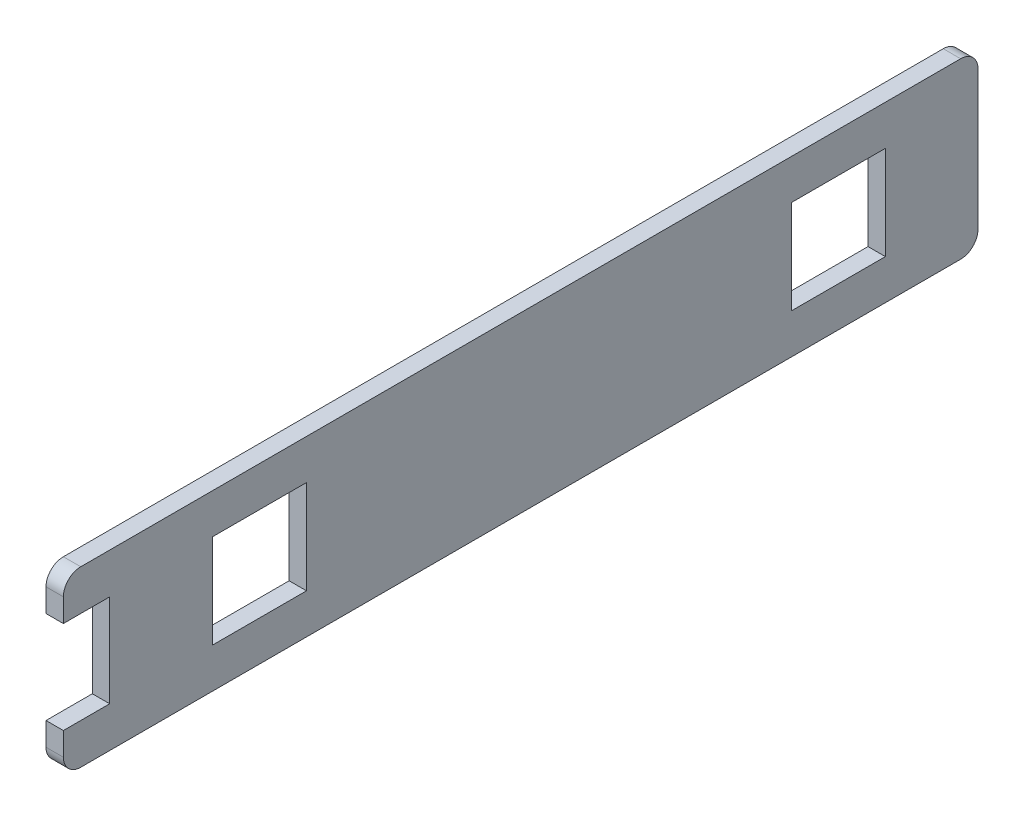
ISO-10303-21;
HEADER;
FILE_DESCRIPTION(('STEP AP214'),'2;1');
FILE_NAME('part.step','',(''),(''),'','','');
FILE_SCHEMA(('AUTOMOTIVE_DESIGN { 1 0 10303 214 1 1 1 1 }'));
ENDSEC;
DATA;
#1=APPLICATION_CONTEXT('core data for automotive mechanical design processes');
#2=APPLICATION_PROTOCOL_DEFINITION('international standard','automotive_design',2000,#1);
#3=PRODUCT_CONTEXT('',#1,'mechanical');
#4=PRODUCT('Part','Part','',(#3));
#5=PRODUCT_RELATED_PRODUCT_CATEGORY('part','',(#4));
#6=PRODUCT_DEFINITION_FORMATION('','',#4);
#7=PRODUCT_DEFINITION_CONTEXT('part definition',#1,'design');
#8=PRODUCT_DEFINITION('design','',#6,#7);
#9=PRODUCT_DEFINITION_SHAPE('','',#8);
#10=(LENGTH_UNIT() NAMED_UNIT(*) SI_UNIT(.MILLI.,.METRE.));
#11=(NAMED_UNIT(*) PLANE_ANGLE_UNIT() SI_UNIT($,.RADIAN.));
#12=(NAMED_UNIT(*) SI_UNIT($,.STERADIAN.) SOLID_ANGLE_UNIT());
#13=UNCERTAINTY_MEASURE_WITH_UNIT(LENGTH_MEASURE(1.E-05),#10,'distance_accuracy_value','');
#14=(GEOMETRIC_REPRESENTATION_CONTEXT(3) GLOBAL_UNCERTAINTY_ASSIGNED_CONTEXT((#13)) GLOBAL_UNIT_ASSIGNED_CONTEXT((#10,
#11,#12)) REPRESENTATION_CONTEXT('',''));
#15=CARTESIAN_POINT('',(0.,0.,0.));
#16=DIRECTION('',(0.,0.,1.));
#17=DIRECTION('',(1.,0.,0.));
#18=AXIS2_PLACEMENT_3D('',#15,#16,#17);
#19=CARTESIAN_POINT('',(630.000000000001,-2.70932974371986E-13,-790.));
#20=DIRECTION('',(0.,0.,-1.));
#21=DIRECTION('',(-1.,0.,0.));
#22=AXIS2_PLACEMENT_3D('',#19,#20,#21);
#23=PLANE('',#22);
#24=DIRECTION('',(0.,1.,0.));
#25=VECTOR('',#24,1.);
#26=CARTESIAN_POINT('',(645.000000000001,-2.7644388496815E-13,-790.));
#27=LINE('',#26,#25);
#28=CARTESIAN_POINT('',(645.000000000001,-0.500000000000002,-790.));
#29=VERTEX_POINT('',#28);
#30=CARTESIAN_POINT('',(645.000000000001,80.5,-790.));
#31=VERTEX_POINT('',#30);
#32=EDGE_CURVE('E263',#29,#31,#27,.T.);
#33=ORIENTED_EDGE('',*,*,#32,.T.);
#34=DIRECTION('',(1.,0.,0.));
#35=VECTOR('',#34,1.);
#36=CARTESIAN_POINT('',(630.000000000001,80.5,-790.));
#37=LINE('',#36,#35);
#38=CARTESIAN_POINT('',(630.000000000001,80.5,-790.));
#39=VERTEX_POINT('',#38);
#40=EDGE_CURVE('E283',#39,#31,#37,.T.);
#41=ORIENTED_EDGE('',*,*,#40,.F.);
#42=DIRECTION('',(0.,1.,0.));
#43=VECTOR('',#42,1.);
#44=CARTESIAN_POINT('',(630.000000000001,-2.70932974371986E-13,-790.));
#45=LINE('',#44,#43);
#46=CARTESIAN_POINT('',(630.000000000001,-0.499999999999996,-790.));
#47=VERTEX_POINT('',#46);
#48=EDGE_CURVE('E220',#47,#39,#45,.T.);
#49=ORIENTED_EDGE('',*,*,#48,.F.);
#50=DIRECTION('',(1.,0.,0.));
#51=VECTOR('',#50,1.);
#52=CARTESIAN_POINT('',(630.000000000001,-0.499999999999996,-790.));
#53=LINE('',#52,#51);
#54=EDGE_CURVE('E275',#47,#29,#53,.T.);
#55=ORIENTED_EDGE('',*,*,#54,.T.);
#56=EDGE_LOOP('',(#33,#41,#49,#55));
#57=FACE_BOUND('',#56,.T.);
#58=ADVANCED_FACE('F34',(#57),#23,.F.);
#59=CARTESIAN_POINT('',(630.,80.5,2.69782546820399E-13));
#60=DIRECTION('',(0.,-1.,0.));
#61=DIRECTION('',(1.,0.,0.));
#62=AXIS2_PLACEMENT_3D('',#59,#60,#61);
#63=PLANE('',#62);
#64=DIRECTION('',(0.,0.,-1.));
#65=VECTOR('',#64,1.);
#66=CARTESIAN_POINT('',(645.,80.5,2.7644388496815E-13));
#67=LINE('',#66,#65);
#68=CARTESIAN_POINT('',(645.000000000001,80.5,-709.));
#69=VERTEX_POINT('',#68);
#70=EDGE_CURVE('E266',#69,#31,#67,.T.);
#71=ORIENTED_EDGE('',*,*,#70,.F.);
#72=DIRECTION('',(1.,0.,0.));
#73=VECTOR('',#72,1.);
#74=CARTESIAN_POINT('',(630.000000000001,80.5,-709.));
#75=LINE('',#74,#73);
#76=CARTESIAN_POINT('',(630.000000000001,80.5,-709.));
#77=VERTEX_POINT('',#76);
#78=EDGE_CURVE('E281',#77,#69,#75,.T.);
#79=ORIENTED_EDGE('',*,*,#78,.F.);
#80=DIRECTION('',(0.,0.,-1.));
#81=VECTOR('',#80,1.);
#82=CARTESIAN_POINT('',(630.,80.5,2.69782546820399E-13));
#83=LINE('',#82,#81);
#84=EDGE_CURVE('E222',#77,#39,#83,.T.);
#85=ORIENTED_EDGE('',*,*,#84,.T.);
#86=ORIENTED_EDGE('',*,*,#40,.T.);
#87=EDGE_LOOP('',(#71,#79,#85,#86));
#88=FACE_BOUND('',#87,.T.);
#89=ADVANCED_FACE('F367',(#88),#63,.T.);
#90=CARTESIAN_POINT('',(630.000000000001,-2.70932974371986E-13,-709.));
#91=DIRECTION('',(0.,0.,-1.));
#92=DIRECTION('',(-1.,0.,0.));
#93=AXIS2_PLACEMENT_3D('',#90,#91,#92);
#94=PLANE('',#93);
#95=DIRECTION('',(0.,1.,0.));
#96=VECTOR('',#95,1.);
#97=CARTESIAN_POINT('',(645.000000000001,-2.7644388496815E-13,-709.));
#98=LINE('',#97,#96);
#99=CARTESIAN_POINT('',(645.000000000001,-0.500000000000002,-709.));
#100=VERTEX_POINT('',#99);
#101=EDGE_CURVE('E269',#100,#69,#98,.T.);
#102=ORIENTED_EDGE('',*,*,#101,.F.);
#103=DIRECTION('',(1.,0.,0.));
#104=VECTOR('',#103,1.);
#105=CARTESIAN_POINT('',(630.000000000001,-0.499999999999996,-709.));
#106=LINE('',#105,#104);
#107=CARTESIAN_POINT('',(630.000000000001,-0.499999999999996,-709.));
#108=VERTEX_POINT('',#107);
#109=EDGE_CURVE('E278',#108,#100,#106,.T.);
#110=ORIENTED_EDGE('',*,*,#109,.F.);
#111=DIRECTION('',(0.,1.,0.));
#112=VECTOR('',#111,1.);
#113=CARTESIAN_POINT('',(630.000000000001,-2.70932974371986E-13,-709.));
#114=LINE('',#113,#112);
#115=EDGE_CURVE('E225',#108,#77,#114,.T.);
#116=ORIENTED_EDGE('',*,*,#115,.T.);
#117=ORIENTED_EDGE('',*,*,#78,.T.);
#118=EDGE_LOOP('',(#102,#110,#116,#117));
#119=FACE_BOUND('',#118,.T.);
#120=ADVANCED_FACE('F373',(#119),#94,.T.);
#121=CARTESIAN_POINT('',(630.,80.5,2.69782546820399E-13));
#122=DIRECTION('',(0.,-1.,0.));
#123=DIRECTION('',(1.,0.,0.));
#124=AXIS2_PLACEMENT_3D('',#121,#122,#123);
#125=PLANE('',#124);
#126=DIRECTION('',(0.,0.,-1.));
#127=VECTOR('',#126,1.);
#128=CARTESIAN_POINT('',(645.,80.5,2.7644388496815E-13));
#129=LINE('',#128,#127);
#130=CARTESIAN_POINT('',(645.,80.5,-208.999999999999));
#131=VERTEX_POINT('',#130);
#132=CARTESIAN_POINT('',(645.,80.5,-289.999999999999));
#133=VERTEX_POINT('',#132);
#134=EDGE_CURVE('E251',#131,#133,#129,.T.);
#135=ORIENTED_EDGE('',*,*,#134,.F.);
#136=DIRECTION('',(1.,0.,0.));
#137=VECTOR('',#136,1.);
#138=CARTESIAN_POINT('',(630.,80.5,-208.999999999999));
#139=LINE('',#138,#137);
#140=CARTESIAN_POINT('',(630.,80.5,-208.999999999999));
#141=VERTEX_POINT('',#140);
#142=EDGE_CURVE('E279',#141,#131,#139,.T.);
#143=ORIENTED_EDGE('',*,*,#142,.F.);
#144=DIRECTION('',(0.,0.,-1.));
#145=VECTOR('',#144,1.);
#146=CARTESIAN_POINT('',(630.,80.5,2.69782546820399E-13));
#147=LINE('',#146,#145);
#148=CARTESIAN_POINT('',(630.,80.5,-289.999999999999));
#149=VERTEX_POINT('',#148);
#150=EDGE_CURVE('E209',#141,#149,#147,.T.);
#151=ORIENTED_EDGE('',*,*,#150,.T.);
#152=DIRECTION('',(1.,0.,0.));
#153=VECTOR('',#152,1.);
#154=CARTESIAN_POINT('',(630.,80.5,-289.999999999999));
#155=LINE('',#154,#153);
#156=EDGE_CURVE('E193',#149,#133,#155,.T.);
#157=ORIENTED_EDGE('',*,*,#156,.T.);
#158=EDGE_LOOP('',(#135,#143,#151,#157));
#159=FACE_BOUND('',#158,.T.);
#160=ADVANCED_FACE('F390',(#159),#125,.T.);
#161=CARTESIAN_POINT('',(630.,-2.70932974371986E-13,-208.999999999999));
#162=DIRECTION('',(0.,0.,-1.));
#163=DIRECTION('',(-1.,0.,0.));
#164=AXIS2_PLACEMENT_3D('',#161,#162,#163);
#165=PLANE('',#164);
#166=DIRECTION('',(0.,1.,0.));
#167=VECTOR('',#166,1.);
#168=CARTESIAN_POINT('',(645.,-2.7644388496815E-13,-208.999999999999));
#169=LINE('',#168,#167);
#170=CARTESIAN_POINT('',(645.,-0.500000000000015,-208.999999999999));
#171=VERTEX_POINT('',#170);
#172=EDGE_CURVE('E254',#171,#131,#169,.T.);
#173=ORIENTED_EDGE('',*,*,#172,.F.);
#174=DIRECTION('',(1.,0.,0.));
#175=VECTOR('',#174,1.);
#176=CARTESIAN_POINT('',(630.,-0.50000000000001,-208.999999999999));
#177=LINE('',#176,#175);
#178=CARTESIAN_POINT('',(630.,-0.50000000000001,-208.999999999999));
#179=VERTEX_POINT('',#178);
#180=EDGE_CURVE('E290',#179,#171,#177,.T.);
#181=ORIENTED_EDGE('',*,*,#180,.F.);
#182=DIRECTION('',(0.,1.,0.));
#183=VECTOR('',#182,1.);
#184=CARTESIAN_POINT('',(630.,-2.70932974371986E-13,-208.999999999999));
#185=LINE('',#184,#183);
#186=EDGE_CURVE('E212',#179,#141,#185,.T.);
#187=ORIENTED_EDGE('',*,*,#186,.T.);
#188=ORIENTED_EDGE('',*,*,#142,.T.);
#189=EDGE_LOOP('',(#173,#181,#187,#188));
#190=FACE_BOUND('',#189,.T.);
#191=ADVANCED_FACE('F386',(#190),#165,.T.);
#192=CARTESIAN_POINT('',(630.,-0.50000000000001,2.69782546820399E-13));
#193=DIRECTION('',(0.,-1.,0.));
#194=DIRECTION('',(1.,0.,0.));
#195=AXIS2_PLACEMENT_3D('',#192,#193,#194);
#196=PLANE('',#195);
#197=DIRECTION('',(0.,0.,-1.));
#198=VECTOR('',#197,1.);
#199=CARTESIAN_POINT('',(645.,-0.500000000000015,2.7644388496815E-13));
#200=LINE('',#199,#198);
#201=CARTESIAN_POINT('',(645.,-0.500000000000015,-289.999999999999));
#202=VERTEX_POINT('',#201);
#203=EDGE_CURVE('E257',#171,#202,#200,.T.);
#204=ORIENTED_EDGE('',*,*,#203,.T.);
#205=DIRECTION('',(1.,0.,0.));
#206=VECTOR('',#205,1.);
#207=CARTESIAN_POINT('',(630.,-0.50000000000001,-289.999999999999));
#208=LINE('',#207,#206);
#209=CARTESIAN_POINT('',(630.,-0.50000000000001,-289.999999999999));
#210=VERTEX_POINT('',#209);
#211=EDGE_CURVE('E287',#210,#202,#208,.T.);
#212=ORIENTED_EDGE('',*,*,#211,.F.);
#213=DIRECTION('',(0.,0.,-1.));
#214=VECTOR('',#213,1.);
#215=CARTESIAN_POINT('',(630.,-0.50000000000001,2.69782546820399E-13));
#216=LINE('',#215,#214);
#217=EDGE_CURVE('E215',#179,#210,#216,.T.);
#218=ORIENTED_EDGE('',*,*,#217,.F.);
#219=ORIENTED_EDGE('',*,*,#180,.T.);
#220=EDGE_LOOP('',(#204,#212,#218,#219));
#221=FACE_BOUND('',#220,.T.);
#222=ADVANCED_FACE('F383',(#221),#196,.F.);
#223=CARTESIAN_POINT('',(630.,115.,2.69782546820399E-13));
#224=DIRECTION('',(0.,-1.,0.));
#225=DIRECTION('',(1.,0.,0.));
#226=AXIS2_PLACEMENT_3D('',#223,#224,#225);
#227=PLANE('',#226);
#228=DIRECTION('',(0.,0.,-1.));
#229=VECTOR('',#228,1.);
#230=CARTESIAN_POINT('',(630.,115.,2.69782546820399E-13));
#231=LINE('',#230,#229);
#232=CARTESIAN_POINT('',(630.,115.,-95.0000000000012));
#233=VERTEX_POINT('',#232);
#234=CARTESIAN_POINT('',(630.000000000001,115.,-855.000000000001));
#235=VERTEX_POINT('',#234);
#236=EDGE_CURVE('E274',#233,#235,#231,.T.);
#237=ORIENTED_EDGE('',*,*,#236,.F.);
#238=DIRECTION('',(1.,0.,0.));
#239=VECTOR('',#238,1.);
#240=CARTESIAN_POINT('',(645.,115.,-95.0000000000012));
#241=LINE('',#240,#239);
#242=CARTESIAN_POINT('',(645.,115.,-95.0000000000012));
#243=VERTEX_POINT('',#242);
#244=EDGE_CURVE('E320',#233,#243,#241,.T.);
#245=ORIENTED_EDGE('',*,*,#244,.T.);
#246=DIRECTION('',(0.,0.,-1.));
#247=VECTOR('',#246,1.);
#248=CARTESIAN_POINT('',(645.,115.,2.7644388496815E-13));
#249=LINE('',#248,#247);
#250=CARTESIAN_POINT('',(645.000000000001,115.,-855.000000000001));
#251=VERTEX_POINT('',#250);
#252=EDGE_CURVE('E231',#243,#251,#249,.T.);
#253=ORIENTED_EDGE('',*,*,#252,.T.);
#254=DIRECTION('',(1.,0.,0.));
#255=VECTOR('',#254,1.);
#256=CARTESIAN_POINT('',(630.000000000001,115.,-855.000000000001));
#257=LINE('',#256,#255);
#258=EDGE_CURVE('E318',#251,#235,#257,.F.);
#259=ORIENTED_EDGE('',*,*,#258,.T.);
#260=EDGE_LOOP('',(#237,#245,#253,#259));
#261=FACE_BOUND('',#260,.T.);
#262=ADVANCED_FACE('F351',(#261),#227,.F.);
#263=CARTESIAN_POINT('',(630.000000000001,-2.70932974371986E-13,-870.000000000001));
#264=DIRECTION('',(0.,0.,-1.));
#265=DIRECTION('',(-1.,0.,0.));
#266=AXIS2_PLACEMENT_3D('',#263,#264,#265);
#267=PLANE('',#266);
#268=DIRECTION('',(0.,1.,0.));
#269=VECTOR('',#268,1.);
#270=CARTESIAN_POINT('',(645.000000000001,-2.7644388496815E-13,-870.000000000001));
#271=LINE('',#270,#269);
#272=CARTESIAN_POINT('',(645.000000000001,-20.,-870.000000000001));
#273=VERTEX_POINT('',#272);
#274=CARTESIAN_POINT('',(645.000000000001,100.,-870.000000000001));
#275=VERTEX_POINT('',#274);
#276=EDGE_CURVE('E234',#273,#275,#271,.T.);
#277=ORIENTED_EDGE('',*,*,#276,.F.);
#278=DIRECTION('',(1.,0.,0.));
#279=VECTOR('',#278,1.);
#280=CARTESIAN_POINT('',(630.000000000001,-20.,-870.000000000001));
#281=LINE('',#280,#279);
#282=CARTESIAN_POINT('',(630.000000000001,-20.,-870.000000000001));
#283=VERTEX_POINT('',#282);
#284=EDGE_CURVE('E11',#273,#283,#281,.F.);
#285=ORIENTED_EDGE('',*,*,#284,.T.);
#286=DIRECTION('',(0.,1.,0.));
#287=VECTOR('',#286,1.);
#288=CARTESIAN_POINT('',(630.000000000001,-2.70932974371986E-13,-870.000000000001));
#289=LINE('',#288,#287);
#290=CARTESIAN_POINT('',(630.000000000001,100.,-870.000000000001));
#291=VERTEX_POINT('',#290);
#292=EDGE_CURVE('E329',#283,#291,#289,.T.);
#293=ORIENTED_EDGE('',*,*,#292,.T.);
#294=DIRECTION('',(1.,0.,0.));
#295=VECTOR('',#294,1.);
#296=CARTESIAN_POINT('',(645.000000000001,100.,-870.000000000001));
#297=LINE('',#296,#295);
#298=EDGE_CURVE('E42',#291,#275,#297,.T.);
#299=ORIENTED_EDGE('',*,*,#298,.T.);
#300=EDGE_LOOP('',(#277,#285,#293,#299));
#301=FACE_BOUND('',#300,.T.);
#302=ADVANCED_FACE('F327',(#301),#267,.T.);
#303=CARTESIAN_POINT('',(630.,-35.,2.69782546820399E-13));
#304=DIRECTION('',(0.,1.,0.));
#305=DIRECTION('',(-1.,0.,0.));
#306=AXIS2_PLACEMENT_3D('',#303,#304,#305);
#307=PLANE('',#306);
#308=DIRECTION('',(0.,0.,1.));
#309=VECTOR('',#308,1.);
#310=CARTESIAN_POINT('',(645.,-35.,2.7644388496815E-13));
#311=LINE('',#310,#309);
#312=CARTESIAN_POINT('',(645.000000000001,-35.,-855.000000000001));
#313=VERTEX_POINT('',#312);
#314=CARTESIAN_POINT('',(645.,-35.,-95.0000000000012));
#315=VERTEX_POINT('',#314);
#316=EDGE_CURVE('E237',#313,#315,#311,.T.);
#317=ORIENTED_EDGE('',*,*,#316,.T.);
#318=DIRECTION('',(1.,0.,0.));
#319=VECTOR('',#318,1.);
#320=CARTESIAN_POINT('',(630.,-35.,-95.0000000000012));
#321=LINE('',#320,#319);
#322=CARTESIAN_POINT('',(630.,-35.,-95.0000000000012));
#323=VERTEX_POINT('',#322);
#324=EDGE_CURVE('E310',#315,#323,#321,.F.);
#325=ORIENTED_EDGE('',*,*,#324,.T.);
#326=DIRECTION('',(0.,0.,1.));
#327=VECTOR('',#326,1.);
#328=CARTESIAN_POINT('',(630.,-35.,2.69782546820399E-13));
#329=LINE('',#328,#327);
#330=CARTESIAN_POINT('',(630.000000000001,-35.,-855.000000000001));
#331=VERTEX_POINT('',#330);
#332=EDGE_CURVE('E184',#331,#323,#329,.T.);
#333=ORIENTED_EDGE('',*,*,#332,.F.);
#334=DIRECTION('',(1.,0.,0.));
#335=VECTOR('',#334,1.);
#336=CARTESIAN_POINT('',(645.000000000001,-35.,-855.000000000001));
#337=LINE('',#336,#335);
#338=EDGE_CURVE('E307',#331,#313,#337,.T.);
#339=ORIENTED_EDGE('',*,*,#338,.T.);
#340=EDGE_LOOP('',(#317,#325,#333,#339));
#341=FACE_BOUND('',#340,.T.);
#342=ADVANCED_FACE('F342',(#341),#307,.F.);
#343=CARTESIAN_POINT('',(630.,-2.70932974371986E-13,-80.0000000000012));
#344=DIRECTION('',(0.,0.,-1.));
#345=DIRECTION('',(-1.,0.,0.));
#346=AXIS2_PLACEMENT_3D('',#343,#344,#345);
#347=PLANE('',#346);
#348=DIRECTION('',(0.,1.,0.));
#349=VECTOR('',#348,1.);
#350=CARTESIAN_POINT('',(630.,-2.70932974371986E-13,-80.0000000000012));
#351=LINE('',#350,#349);
#352=CARTESIAN_POINT('',(630.,-20.,-80.0000000000012));
#353=VERTEX_POINT('',#352);
#354=CARTESIAN_POINT('',(630.,-7.80232127397164E-13,-80.0000000000012));
#355=VERTEX_POINT('',#354);
#356=EDGE_CURVE('E171',#353,#355,#351,.T.);
#357=ORIENTED_EDGE('',*,*,#356,.F.);
#358=DIRECTION('',(1.,0.,0.));
#359=VECTOR('',#358,1.);
#360=CARTESIAN_POINT('',(630.,-20.,-80.0000000000012));
#361=LINE('',#360,#359);
#362=CARTESIAN_POINT('',(645.,-20.,-80.0000000000012));
#363=VERTEX_POINT('',#362);
#364=EDGE_CURVE('E285',#353,#363,#361,.T.);
#365=ORIENTED_EDGE('',*,*,#364,.T.);
#366=DIRECTION('',(0.,1.,0.));
#367=VECTOR('',#366,1.);
#368=CARTESIAN_POINT('',(645.,-2.7644388496815E-13,-80.0000000000012));
#369=LINE('',#368,#367);
#370=CARTESIAN_POINT('',(645.,-7.85743037993328E-13,-80.0000000000012));
#371=VERTEX_POINT('',#370);
#372=EDGE_CURVE('E190',#363,#371,#369,.T.);
#373=ORIENTED_EDGE('',*,*,#372,.T.);
#374=DIRECTION('',(1.,0.,0.));
#375=VECTOR('',#374,1.);
#376=CARTESIAN_POINT('',(630.,-7.80232127397164E-13,-80.0000000000012));
#377=LINE('',#376,#375);
#378=EDGE_CURVE('E187',#355,#371,#377,.T.);
#379=ORIENTED_EDGE('',*,*,#378,.F.);
#380=EDGE_LOOP('',(#357,#365,#373,#379));
#381=FACE_BOUND('',#380,.T.);
#382=ADVANCED_FACE('F188',(#381),#347,.F.);
#383=CARTESIAN_POINT('',(630.,-1.13235357946908E-13,2.69782546820397E-13));
#384=DIRECTION('',(0.,-1.,0.));
#385=DIRECTION('',(0.,0.,-1.));
#386=AXIS2_PLACEMENT_3D('',#383,#384,#385);
#387=PLANE('',#386);
#388=DIRECTION('',(0.,0.,-1.));
#389=VECTOR('',#388,1.);
#390=CARTESIAN_POINT('',(645.,-1.18746268543072E-13,2.76443884968148E-13));
#391=LINE('',#390,#389);
#392=CARTESIAN_POINT('',(645.,-5.06816847453418E-11,-120.000000000001));
#393=VERTEX_POINT('',#392);
#394=EDGE_CURVE('E241',#371,#393,#391,.T.);
#395=ORIENTED_EDGE('',*,*,#394,.T.);
#396=DIRECTION('',(1.,0.,0.));
#397=VECTOR('',#396,1.);
#398=CARTESIAN_POINT('',(630.,-5.06761738347456E-11,-120.000000000001));
#399=LINE('',#398,#397);
#400=CARTESIAN_POINT('',(630.,-5.06761738347456E-11,-120.000000000001));
#401=VERTEX_POINT('',#400);
#402=EDGE_CURVE('E194',#401,#393,#399,.T.);
#403=ORIENTED_EDGE('',*,*,#402,.F.);
#404=DIRECTION('',(0.,0.,-1.));
#405=VECTOR('',#404,1.);
#406=CARTESIAN_POINT('',(630.,-1.13235357946908E-13,2.69782546820397E-13));
#407=LINE('',#406,#405);
#408=EDGE_CURVE('E177',#355,#401,#407,.T.);
#409=ORIENTED_EDGE('',*,*,#408,.F.);
#410=ORIENTED_EDGE('',*,*,#378,.T.);
#411=EDGE_LOOP('',(#395,#403,#409,#410));
#412=FACE_BOUND('',#411,.T.);
#413=ADVANCED_FACE('F196',(#412),#387,.F.);
#414=CARTESIAN_POINT('',(630.,-2.70932974371986E-13,-120.000000000001));
#415=DIRECTION('',(0.,0.,-1.));
#416=DIRECTION('',(-1.,0.,0.));
#417=AXIS2_PLACEMENT_3D('',#414,#415,#416);
#418=PLANE('',#417);
#419=DIRECTION('',(0.,1.,0.));
#420=VECTOR('',#419,1.);
#421=CARTESIAN_POINT('',(645.,-2.7644388496815E-13,-120.000000000001));
#422=LINE('',#421,#420);
#423=CARTESIAN_POINT('',(645.,79.9999999999989,-120.000000000001));
#424=VERTEX_POINT('',#423);
#425=EDGE_CURVE('E243',#393,#424,#422,.T.);
#426=ORIENTED_EDGE('',*,*,#425,.T.);
#427=DIRECTION('',(1.,0.,0.));
#428=VECTOR('',#427,1.);
#429=CARTESIAN_POINT('',(630.,79.9999999999989,-120.000000000001));
#430=LINE('',#429,#428);
#431=CARTESIAN_POINT('',(630.,79.9999999999989,-120.000000000001));
#432=VERTEX_POINT('',#431);
#433=EDGE_CURVE('E295',#432,#424,#430,.T.);
#434=ORIENTED_EDGE('',*,*,#433,.F.);
#435=DIRECTION('',(0.,1.,0.));
#436=VECTOR('',#435,1.);
#437=CARTESIAN_POINT('',(630.,-2.70932974371986E-13,-120.000000000001));
#438=LINE('',#437,#436);
#439=EDGE_CURVE('E199',#401,#432,#438,.T.);
#440=ORIENTED_EDGE('',*,*,#439,.F.);
#441=ORIENTED_EDGE('',*,*,#402,.T.);
#442=EDGE_LOOP('',(#426,#434,#440,#441));
#443=FACE_BOUND('',#442,.T.);
#444=ADVANCED_FACE('F400',(#443),#418,.F.);
#445=CARTESIAN_POINT('',(630.,80.,2.69782546820399E-13));
#446=DIRECTION('',(0.,-1.,0.));
#447=DIRECTION('',(1.,0.,0.));
#448=AXIS2_PLACEMENT_3D('',#445,#446,#447);
#449=PLANE('',#448);
#450=DIRECTION('',(0.,0.,-1.));
#451=VECTOR('',#450,1.);
#452=CARTESIAN_POINT('',(645.,80.,2.7644388496815E-13));
#453=LINE('',#452,#451);
#454=CARTESIAN_POINT('',(645.,80.,-80.0000000000012));
#455=VERTEX_POINT('',#454);
#456=EDGE_CURVE('E246',#455,#424,#453,.T.);
#457=ORIENTED_EDGE('',*,*,#456,.F.);
#458=DIRECTION('',(1.,0.,0.));
#459=VECTOR('',#458,1.);
#460=CARTESIAN_POINT('',(630.,80.,-80.0000000000012));
#461=LINE('',#460,#459);
#462=CARTESIAN_POINT('',(630.,80.,-80.0000000000012));
#463=VERTEX_POINT('',#462);
#464=EDGE_CURVE('E230',#463,#455,#461,.T.);
#465=ORIENTED_EDGE('',*,*,#464,.F.);
#466=DIRECTION('',(0.,0.,-1.));
#467=VECTOR('',#466,1.);
#468=CARTESIAN_POINT('',(630.,80.,2.69782546820399E-13));
#469=LINE('',#468,#467);
#470=EDGE_CURVE('E201',#463,#432,#469,.T.);
#471=ORIENTED_EDGE('',*,*,#470,.T.);
#472=ORIENTED_EDGE('',*,*,#433,.T.);
#473=EDGE_LOOP('',(#457,#465,#471,#472));
#474=FACE_BOUND('',#473,.T.);
#475=ADVANCED_FACE('F397',(#474),#449,.T.);
#476=CARTESIAN_POINT('',(630.,-0.499999999999996,2.69782546820399E-13));
#477=DIRECTION('',(0.,-1.,0.));
#478=DIRECTION('',(1.,0.,0.));
#479=AXIS2_PLACEMENT_3D('',#476,#477,#478);
#480=PLANE('',#479);
#481=DIRECTION('',(0.,0.,-1.));
#482=VECTOR('',#481,1.);
#483=CARTESIAN_POINT('',(645.,-0.500000000000002,2.7644388496815E-13));
#484=LINE('',#483,#482);
#485=EDGE_CURVE('E272',#100,#29,#484,.T.);
#486=ORIENTED_EDGE('',*,*,#485,.T.);
#487=ORIENTED_EDGE('',*,*,#54,.F.);
#488=DIRECTION('',(0.,0.,-1.));
#489=VECTOR('',#488,1.);
#490=CARTESIAN_POINT('',(630.,-0.499999999999996,2.69782546820399E-13));
#491=LINE('',#490,#489);
#492=EDGE_CURVE('E228',#108,#47,#491,.T.);
#493=ORIENTED_EDGE('',*,*,#492,.F.);
#494=ORIENTED_EDGE('',*,*,#109,.T.);
#495=EDGE_LOOP('',(#486,#487,#493,#494));
#496=FACE_BOUND('',#495,.T.);
#497=ADVANCED_FACE('F381',(#496),#480,.F.);
#498=CARTESIAN_POINT('',(630.,-2.70932974371986E-13,-289.999999999999));
#499=DIRECTION('',(0.,0.,-1.));
#500=DIRECTION('',(-1.,0.,0.));
#501=AXIS2_PLACEMENT_3D('',#498,#499,#500);
#502=PLANE('',#501);
#503=DIRECTION('',(0.,1.,0.));
#504=VECTOR('',#503,1.);
#505=CARTESIAN_POINT('',(645.,-2.7644388496815E-13,-289.999999999999));
#506=LINE('',#505,#504);
#507=EDGE_CURVE('E260',#202,#133,#506,.T.);
#508=ORIENTED_EDGE('',*,*,#507,.T.);
#509=ORIENTED_EDGE('',*,*,#156,.F.);
#510=DIRECTION('',(0.,1.,0.));
#511=VECTOR('',#510,1.);
#512=CARTESIAN_POINT('',(630.,-2.70932974371986E-13,-289.999999999999));
#513=LINE('',#512,#511);
#514=EDGE_CURVE('E218',#210,#149,#513,.T.);
#515=ORIENTED_EDGE('',*,*,#514,.F.);
#516=ORIENTED_EDGE('',*,*,#211,.T.);
#517=EDGE_LOOP('',(#508,#509,#515,#516));
#518=FACE_BOUND('',#517,.T.);
#519=ADVANCED_FACE('F378',(#518),#502,.F.);
#520=CARTESIAN_POINT('',(630.,-2.70932974371986E-13,-80.0000000000012));
#521=DIRECTION('',(0.,0.,1.));
#522=DIRECTION('',(1.,0.,0.));
#523=AXIS2_PLACEMENT_3D('',#520,#521,#522);
#524=PLANE('',#523);
#525=DIRECTION('',(0.,-1.,0.));
#526=VECTOR('',#525,1.);
#527=CARTESIAN_POINT('',(645.,-2.7644388496815E-13,-80.0000000000012));
#528=LINE('',#527,#526);
#529=CARTESIAN_POINT('',(645.,100.,-80.0000000000012));
#530=VERTEX_POINT('',#529);
#531=EDGE_CURVE('E249',#530,#455,#528,.T.);
#532=ORIENTED_EDGE('',*,*,#531,.F.);
#533=DIRECTION('',(1.,0.,0.));
#534=VECTOR('',#533,1.);
#535=CARTESIAN_POINT('',(630.,100.,-80.0000000000012));
#536=LINE('',#535,#534);
#537=CARTESIAN_POINT('',(630.,100.,-80.0000000000012));
#538=VERTEX_POINT('',#537);
#539=EDGE_CURVE('E49',#530,#538,#536,.F.);
#540=ORIENTED_EDGE('',*,*,#539,.T.);
#541=DIRECTION('',(0.,-1.,0.));
#542=VECTOR('',#541,1.);
#543=CARTESIAN_POINT('',(630.,-2.70932974371986E-13,-80.0000000000012));
#544=LINE('',#543,#542);
#545=EDGE_CURVE('E207',#538,#463,#544,.T.);
#546=ORIENTED_EDGE('',*,*,#545,.T.);
#547=ORIENTED_EDGE('',*,*,#464,.T.);
#548=EDGE_LOOP('',(#532,#540,#546,#547));
#549=FACE_BOUND('',#548,.T.);
#550=ADVANCED_FACE('F353',(#549),#524,.T.);
#551=CARTESIAN_POINT('',(630.,-2.70932974371986E-13,2.69782546820399E-13));
#552=DIRECTION('',(-1.,0.,0.));
#553=DIRECTION('',(0.,0.,1.));
#554=AXIS2_PLACEMENT_3D('',#551,#552,#553);
#555=PLANE('',#554);
#556=ORIENTED_EDGE('',*,*,#332,.T.);
#557=CARTESIAN_POINT('',(630.,-20.,-95.0000000000012));
#558=DIRECTION('',(-1.,0.,0.));
#559=DIRECTION('',(0.,0.,1.));
#560=AXIS2_PLACEMENT_3D('',#557,#558,#559);
#561=CIRCLE('',#560,15.);
#562=EDGE_CURVE('E180',#323,#353,#561,.T.);
#563=ORIENTED_EDGE('',*,*,#562,.T.);
#564=ORIENTED_EDGE('',*,*,#356,.T.);
#565=ORIENTED_EDGE('',*,*,#408,.T.);
#566=ORIENTED_EDGE('',*,*,#439,.T.);
#567=ORIENTED_EDGE('',*,*,#470,.F.);
#568=ORIENTED_EDGE('',*,*,#545,.F.);
#569=CARTESIAN_POINT('',(630.,100.,-95.0000000000012));
#570=DIRECTION('',(-1.,0.,0.));
#571=DIRECTION('',(0.,0.,1.));
#572=AXIS2_PLACEMENT_3D('',#569,#570,#571);
#573=CIRCLE('',#572,15.);
#574=EDGE_CURVE('E315',#538,#233,#573,.T.);
#575=ORIENTED_EDGE('',*,*,#574,.T.);
#576=ORIENTED_EDGE('',*,*,#236,.T.);
#577=CARTESIAN_POINT('',(630.000000000001,100.,-855.000000000001));
#578=DIRECTION('',(-1.,0.,0.));
#579=DIRECTION('',(0.,0.,1.));
#580=AXIS2_PLACEMENT_3D('',#577,#578,#579);
#581=CIRCLE('',#580,15.);
#582=EDGE_CURVE('E57',#235,#291,#581,.T.);
#583=ORIENTED_EDGE('',*,*,#582,.T.);
#584=ORIENTED_EDGE('',*,*,#292,.F.);
#585=CARTESIAN_POINT('',(630.000000000001,-20.,-855.000000000001));
#586=DIRECTION('',(-1.,0.,0.));
#587=DIRECTION('',(0.,0.,1.));
#588=AXIS2_PLACEMENT_3D('',#585,#586,#587);
#589=CIRCLE('',#588,15.);
#590=EDGE_CURVE('E313',#283,#331,#589,.T.);
#591=ORIENTED_EDGE('',*,*,#590,.T.);
#592=EDGE_LOOP('',(#556,#563,#564,#565,#566,#567,#568,#575,#576,#583,#584,#591));
#593=FACE_BOUND('',#592,.T.);
#594=ORIENTED_EDGE('',*,*,#150,.F.);
#595=ORIENTED_EDGE('',*,*,#186,.F.);
#596=ORIENTED_EDGE('',*,*,#217,.T.);
#597=ORIENTED_EDGE('',*,*,#514,.T.);
#598=EDGE_LOOP('',(#594,#595,#596,#597));
#599=FACE_BOUND('',#598,.T.);
#600=ORIENTED_EDGE('',*,*,#48,.T.);
#601=ORIENTED_EDGE('',*,*,#84,.F.);
#602=ORIENTED_EDGE('',*,*,#115,.F.);
#603=ORIENTED_EDGE('',*,*,#492,.T.);
#604=EDGE_LOOP('',(#600,#601,#602,#603));
#605=FACE_BOUND('',#604,.T.);
#606=ADVANCED_FACE('F174',(#593,#599,#605),#555,.T.);
#607=CARTESIAN_POINT('',(645.,-2.7644388496815E-13,2.7644388496815E-13));
#608=DIRECTION('',(-1.,0.,0.));
#609=DIRECTION('',(0.,0.,1.));
#610=AXIS2_PLACEMENT_3D('',#607,#608,#609);
#611=PLANE('',#610);
#612=ORIENTED_EDGE('',*,*,#372,.F.);
#613=CARTESIAN_POINT('',(645.,-20.,-95.0000000000012));
#614=DIRECTION('',(-1.,0.,0.));
#615=DIRECTION('',(0.,0.,1.));
#616=AXIS2_PLACEMENT_3D('',#613,#614,#615);
#617=CIRCLE('',#616,15.);
#618=EDGE_CURVE('E305',#363,#315,#617,.F.);
#619=ORIENTED_EDGE('',*,*,#618,.T.);
#620=ORIENTED_EDGE('',*,*,#316,.F.);
#621=CARTESIAN_POINT('',(645.000000000001,-20.,-855.000000000001));
#622=DIRECTION('',(-1.,0.,0.));
#623=DIRECTION('',(0.,0.,1.));
#624=AXIS2_PLACEMENT_3D('',#621,#622,#623);
#625=CIRCLE('',#624,15.);
#626=EDGE_CURVE('E301',#313,#273,#625,.F.);
#627=ORIENTED_EDGE('',*,*,#626,.T.);
#628=ORIENTED_EDGE('',*,*,#276,.T.);
#629=CARTESIAN_POINT('',(645.000000000001,100.,-855.000000000001));
#630=DIRECTION('',(-1.,0.,0.));
#631=DIRECTION('',(0.,0.,1.));
#632=AXIS2_PLACEMENT_3D('',#629,#630,#631);
#633=CIRCLE('',#632,15.);
#634=EDGE_CURVE('E299',#275,#251,#633,.F.);
#635=ORIENTED_EDGE('',*,*,#634,.T.);
#636=ORIENTED_EDGE('',*,*,#252,.F.);
#637=CARTESIAN_POINT('',(645.,100.,-95.0000000000012));
#638=DIRECTION('',(-1.,0.,0.));
#639=DIRECTION('',(0.,0.,1.));
#640=AXIS2_PLACEMENT_3D('',#637,#638,#639);
#641=CIRCLE('',#640,15.);
#642=EDGE_CURVE('E303',#243,#530,#641,.F.);
#643=ORIENTED_EDGE('',*,*,#642,.T.);
#644=ORIENTED_EDGE('',*,*,#531,.T.);
#645=ORIENTED_EDGE('',*,*,#456,.T.);
#646=ORIENTED_EDGE('',*,*,#425,.F.);
#647=ORIENTED_EDGE('',*,*,#394,.F.);
#648=EDGE_LOOP('',(#612,#619,#620,#627,#628,#635,#636,#643,#644,#645,#646,#647));
#649=FACE_BOUND('',#648,.T.);
#650=ORIENTED_EDGE('',*,*,#134,.T.);
#651=ORIENTED_EDGE('',*,*,#507,.F.);
#652=ORIENTED_EDGE('',*,*,#203,.F.);
#653=ORIENTED_EDGE('',*,*,#172,.T.);
#654=EDGE_LOOP('',(#650,#651,#652,#653));
#655=FACE_BOUND('',#654,.T.);
#656=ORIENTED_EDGE('',*,*,#32,.F.);
#657=ORIENTED_EDGE('',*,*,#485,.F.);
#658=ORIENTED_EDGE('',*,*,#101,.T.);
#659=ORIENTED_EDGE('',*,*,#70,.T.);
#660=EDGE_LOOP('',(#656,#657,#658,#659));
#661=FACE_BOUND('',#660,.T.);
#662=ADVANCED_FACE('F332',(#649,#655,#661),#611,.F.);
#663=CARTESIAN_POINT('',(630.,-20.,-95.0000000000012));
#664=DIRECTION('',(1.,0.,0.));
#665=DIRECTION('',(0.,0.,-1.));
#666=AXIS2_PLACEMENT_3D('',#663,#664,#665);
#667=CYLINDRICAL_SURFACE('',#666,15.);
#668=ORIENTED_EDGE('',*,*,#562,.F.);
#669=ORIENTED_EDGE('',*,*,#324,.F.);
#670=ORIENTED_EDGE('',*,*,#618,.F.);
#671=ORIENTED_EDGE('',*,*,#364,.F.);
#672=EDGE_LOOP('',(#668,#669,#670,#671));
#673=FACE_BOUND('',#672,.T.);
#674=ADVANCED_FACE('F358',(#673),#667,.T.);
#675=CARTESIAN_POINT('',(630.,100.,-95.0000000000012));
#676=DIRECTION('',(-1.,0.,0.));
#677=DIRECTION('',(0.,0.,1.));
#678=AXIS2_PLACEMENT_3D('',#675,#676,#677);
#679=CYLINDRICAL_SURFACE('',#678,15.);
#680=ORIENTED_EDGE('',*,*,#574,.F.);
#681=ORIENTED_EDGE('',*,*,#539,.F.);
#682=ORIENTED_EDGE('',*,*,#642,.F.);
#683=ORIENTED_EDGE('',*,*,#244,.F.);
#684=EDGE_LOOP('',(#680,#681,#682,#683));
#685=FACE_BOUND('',#684,.T.);
#686=ADVANCED_FACE('F356',(#685),#679,.T.);
#687=CARTESIAN_POINT('',(630.000000000001,-20.,-855.000000000001));
#688=DIRECTION('',(-1.,0.,0.));
#689=DIRECTION('',(0.,0.,1.));
#690=AXIS2_PLACEMENT_3D('',#687,#688,#689);
#691=CYLINDRICAL_SURFACE('',#690,15.);
#692=ORIENTED_EDGE('',*,*,#590,.F.);
#693=ORIENTED_EDGE('',*,*,#284,.F.);
#694=ORIENTED_EDGE('',*,*,#626,.F.);
#695=ORIENTED_EDGE('',*,*,#338,.F.);
#696=EDGE_LOOP('',(#692,#693,#694,#695));
#697=FACE_BOUND('',#696,.T.);
#698=ADVANCED_FACE('F339',(#697),#691,.T.);
#699=CARTESIAN_POINT('',(630.000000000001,100.,-855.000000000001));
#700=DIRECTION('',(-1.,0.,0.));
#701=DIRECTION('',(0.,0.,1.));
#702=AXIS2_PLACEMENT_3D('',#699,#700,#701);
#703=CYLINDRICAL_SURFACE('',#702,15.);
#704=ORIENTED_EDGE('',*,*,#582,.F.);
#705=ORIENTED_EDGE('',*,*,#258,.F.);
#706=ORIENTED_EDGE('',*,*,#634,.F.);
#707=ORIENTED_EDGE('',*,*,#298,.F.);
#708=EDGE_LOOP('',(#704,#705,#706,#707));
#709=FACE_BOUND('',#708,.T.);
#710=ADVANCED_FACE('F36',(#709),#703,.T.);
#711=CLOSED_SHELL('',(#58,#89,#120,#160,#191,#222,#262,#302,#342,#382,#413,#444,#475,#497,#519,
#550,#606,#662,#674,#686,#698,#710));
#712=MANIFOLD_SOLID_BREP('B2',#711);
#713=ADVANCED_BREP_SHAPE_REPRESENTATION('',(#18,#712),#14);
#714=SHAPE_DEFINITION_REPRESENTATION(#9,#713);
ENDSEC;
END-ISO-10303-21;
